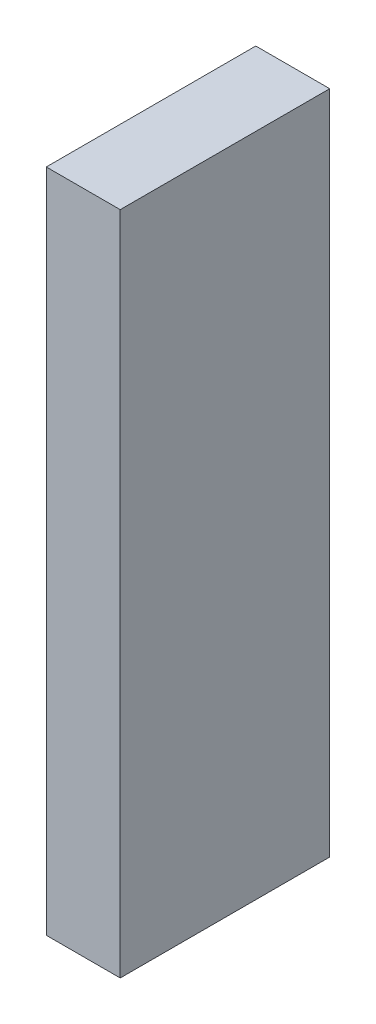
ISO-10303-21;
HEADER;
FILE_DESCRIPTION(('STEP AP214'),'2;1');
FILE_NAME('part.step','',(''),(''),'','','');
FILE_SCHEMA(('AUTOMOTIVE_DESIGN { 1 0 10303 214 1 1 1 1 }'));
ENDSEC;
DATA;
#1=APPLICATION_CONTEXT('core data for automotive mechanical design processes');
#2=APPLICATION_PROTOCOL_DEFINITION('international standard','automotive_design',2000,#1);
#3=PRODUCT_CONTEXT('',#1,'mechanical');
#4=PRODUCT('Part','Part','',(#3));
#5=PRODUCT_RELATED_PRODUCT_CATEGORY('part','',(#4));
#6=PRODUCT_DEFINITION_FORMATION('','',#4);
#7=PRODUCT_DEFINITION_CONTEXT('part definition',#1,'design');
#8=PRODUCT_DEFINITION('design','',#6,#7);
#9=PRODUCT_DEFINITION_SHAPE('','',#8);
#10=(LENGTH_UNIT() NAMED_UNIT(*) SI_UNIT(.MILLI.,.METRE.));
#11=(NAMED_UNIT(*) PLANE_ANGLE_UNIT() SI_UNIT($,.RADIAN.));
#12=(NAMED_UNIT(*) SI_UNIT($,.STERADIAN.) SOLID_ANGLE_UNIT());
#13=UNCERTAINTY_MEASURE_WITH_UNIT(LENGTH_MEASURE(1.E-05),#10,'distance_accuracy_value','');
#14=(GEOMETRIC_REPRESENTATION_CONTEXT(3) GLOBAL_UNCERTAINTY_ASSIGNED_CONTEXT((#13)) GLOBAL_UNIT_ASSIGNED_CONTEXT((#10,
#11,#12)) REPRESENTATION_CONTEXT('',''));
#15=CARTESIAN_POINT('',(0.,0.,0.));
#16=DIRECTION('',(0.,0.,1.));
#17=DIRECTION('',(1.,0.,0.));
#18=AXIS2_PLACEMENT_3D('',#15,#16,#17);
#19=CARTESIAN_POINT('',(2.44999828688201,2.69998244459617,0.));
#20=DIRECTION('',(-1.,1.19248806385031E-08,0.));
#21=DIRECTION('',(-1.19248806385031E-08,-1.,0.));
#22=AXIS2_PLACEMENT_3D('',#19,#20,#21);
#23=PLANE('',#22);
#24=DIRECTION('',(-1.19248806627069E-08,-1.,0.));
#25=VECTOR('',#24,1.);
#26=CARTESIAN_POINT('',(2.44999828688201,2.69998244459617,0.));
#27=LINE('',#26,#25);
#28=CARTESIAN_POINT('',(2.44999828688201,2.69998244459617,0.));
#29=VERTEX_POINT('',#28);
#30=CARTESIAN_POINT('',(2.44999822248774,-2.7000114518882,0.));
#31=VERTEX_POINT('',#30);
#32=EDGE_CURVE('E11',#29,#31,#27,.T.);
#33=ORIENTED_EDGE('',*,*,#32,.T.);
#34=DIRECTION('',(0.,0.,1.));
#35=VECTOR('',#34,1.);
#36=CARTESIAN_POINT('',(2.44999822248773,-2.7000114518882,0.));
#37=LINE('',#36,#35);
#38=CARTESIAN_POINT('',(2.44999822248774,-2.7000114518882,1.6999990940094));
#39=VERTEX_POINT('',#38);
#40=EDGE_CURVE('E88',#31,#39,#37,.T.);
#41=ORIENTED_EDGE('',*,*,#40,.T.);
#42=DIRECTION('',(-1.19248806627069E-08,-1.,0.));
#43=VECTOR('',#42,1.);
#44=CARTESIAN_POINT('',(2.44999828688201,2.69998244459617,1.6999990940094));
#45=LINE('',#44,#43);
#46=CARTESIAN_POINT('',(2.44999828688201,2.69998244459617,1.6999990940094));
#47=VERTEX_POINT('',#46);
#48=EDGE_CURVE('E83',#47,#39,#45,.T.);
#49=ORIENTED_EDGE('',*,*,#48,.F.);
#50=DIRECTION('',(0.,0.,1.));
#51=VECTOR('',#50,1.);
#52=CARTESIAN_POINT('',(2.44999828688201,2.69998244459619,0.));
#53=LINE('',#52,#51);
#54=EDGE_CURVE('E72',#29,#47,#53,.T.);
#55=ORIENTED_EDGE('',*,*,#54,.F.);
#56=EDGE_LOOP('',(#33,#41,#49,#55));
#57=FACE_BOUND('',#56,.T.);
#58=ADVANCED_FACE('F17',(#57),#23,.T.);
#59=CARTESIAN_POINT('',(2.44999822248774,-2.7000114518882,0.));
#60=DIRECTION('',(-1.19248806385031E-08,-1.,0.));
#61=DIRECTION('',(1.,-1.19248806385031E-08,0.));
#62=AXIS2_PLACEMENT_3D('',#59,#60,#61);
#63=PLANE('',#62);
#64=DIRECTION('',(1.,-1.1924880741852E-08,0.));
#65=VECTOR('',#64,1.);
#66=CARTESIAN_POINT('',(2.44999822248774,-2.7000114518882,0.));
#67=LINE('',#66,#65);
#68=CARTESIAN_POINT('',(3.0500005113061,-2.70001145904314,0.));
#69=VERTEX_POINT('',#68);
#70=EDGE_CURVE('E24',#31,#69,#67,.T.);
#71=ORIENTED_EDGE('',*,*,#70,.T.);
#72=DIRECTION('',(0.,0.,1.));
#73=VECTOR('',#72,1.);
#74=CARTESIAN_POINT('',(3.0500005113061,-2.70001145904316,0.));
#75=LINE('',#74,#73);
#76=CARTESIAN_POINT('',(3.0500005113061,-2.70001145904314,1.6999990940094));
#77=VERTEX_POINT('',#76);
#78=EDGE_CURVE('E85',#69,#77,#75,.T.);
#79=ORIENTED_EDGE('',*,*,#78,.T.);
#80=DIRECTION('',(1.,-1.1924880741852E-08,0.));
#81=VECTOR('',#80,1.);
#82=CARTESIAN_POINT('',(2.44999822248774,-2.7000114518882,1.6999990940094));
#83=LINE('',#82,#81);
#84=EDGE_CURVE('E66',#39,#77,#83,.T.);
#85=ORIENTED_EDGE('',*,*,#84,.F.);
#86=ORIENTED_EDGE('',*,*,#40,.F.);
#87=EDGE_LOOP('',(#71,#79,#85,#86));
#88=FACE_BOUND('',#87,.T.);
#89=ADVANCED_FACE('F89',(#88),#63,.T.);
#90=CARTESIAN_POINT('',(3.0500005113061,-2.70001145904314,0.));
#91=DIRECTION('',(1.,-1.19248806385031E-08,0.));
#92=DIRECTION('',(1.19248806385031E-08,1.,0.));
#93=AXIS2_PLACEMENT_3D('',#90,#91,#92);
#94=PLANE('',#93);
#95=DIRECTION('',(1.19248806627069E-08,1.,0.));
#96=VECTOR('',#95,1.);
#97=CARTESIAN_POINT('',(3.0500005113061,-2.70001145904314,0.));
#98=LINE('',#97,#96);
#99=CARTESIAN_POINT('',(3.05000057570037,2.69998243744124,0.));
#100=VERTEX_POINT('',#99);
#101=EDGE_CURVE('E62',#69,#100,#98,.T.);
#102=ORIENTED_EDGE('',*,*,#101,.T.);
#103=DIRECTION('',(0.,0.,1.));
#104=VECTOR('',#103,1.);
#105=CARTESIAN_POINT('',(3.05000057570038,2.69998243744124,0.));
#106=LINE('',#105,#104);
#107=CARTESIAN_POINT('',(3.05000057570037,2.69998243744124,1.6999990940094));
#108=VERTEX_POINT('',#107);
#109=EDGE_CURVE('E55',#100,#108,#106,.T.);
#110=ORIENTED_EDGE('',*,*,#109,.T.);
#111=DIRECTION('',(1.19248806627069E-08,1.,0.));
#112=VECTOR('',#111,1.);
#113=CARTESIAN_POINT('',(3.0500005113061,-2.70001145904314,1.6999990940094));
#114=LINE('',#113,#112);
#115=EDGE_CURVE('E59',#77,#108,#114,.T.);
#116=ORIENTED_EDGE('',*,*,#115,.F.);
#117=ORIENTED_EDGE('',*,*,#78,.F.);
#118=EDGE_LOOP('',(#102,#110,#116,#117));
#119=FACE_BOUND('',#118,.T.);
#120=ADVANCED_FACE('F57',(#119),#94,.T.);
#121=CARTESIAN_POINT('',(3.05000057570037,2.69998243744124,0.));
#122=DIRECTION('',(1.19248806385031E-08,1.,0.));
#123=DIRECTION('',(-1.,1.19248806385031E-08,0.));
#124=AXIS2_PLACEMENT_3D('',#121,#122,#123);
#125=PLANE('',#124);
#126=DIRECTION('',(-1.,1.1924880741852E-08,0.));
#127=VECTOR('',#126,1.);
#128=CARTESIAN_POINT('',(3.05000057570037,2.69998243744124,0.));
#129=LINE('',#128,#127);
#130=EDGE_CURVE('E65',#100,#29,#129,.T.);
#131=ORIENTED_EDGE('',*,*,#130,.T.);
#132=ORIENTED_EDGE('',*,*,#54,.T.);
#133=DIRECTION('',(-1.,1.1924880741852E-08,0.));
#134=VECTOR('',#133,1.);
#135=CARTESIAN_POINT('',(3.05000057570037,2.69998243744124,1.6999990940094));
#136=LINE('',#135,#134);
#137=EDGE_CURVE('E70',#108,#47,#136,.T.);
#138=ORIENTED_EDGE('',*,*,#137,.F.);
#139=ORIENTED_EDGE('',*,*,#109,.F.);
#140=EDGE_LOOP('',(#131,#132,#138,#139));
#141=FACE_BOUND('',#140,.T.);
#142=ADVANCED_FACE('F71',(#141),#125,.T.);
#143=CARTESIAN_POINT('',(65.7749938964844,-429.450012207031,1.6999990940094));
#144=DIRECTION('',(0.,0.,1.));
#145=DIRECTION('',(1.19248806385031E-08,1.,0.));
#146=AXIS2_PLACEMENT_3D('',#143,#144,#145);
#147=PLANE('',#146);
#148=ORIENTED_EDGE('',*,*,#48,.T.);
#149=ORIENTED_EDGE('',*,*,#84,.T.);
#150=ORIENTED_EDGE('',*,*,#115,.T.);
#151=ORIENTED_EDGE('',*,*,#137,.T.);
#152=EDGE_LOOP('',(#148,#149,#150,#151));
#153=FACE_BOUND('',#152,.T.);
#154=ADVANCED_FACE('F76',(#153),#147,.T.);
#155=CARTESIAN_POINT('',(65.7749938964844,-429.450012207031,0.));
#156=DIRECTION('',(0.,0.,1.));
#157=DIRECTION('',(1.19248806385031E-08,1.,0.));
#158=AXIS2_PLACEMENT_3D('',#155,#156,#157);
#159=PLANE('',#158);
#160=ORIENTED_EDGE('',*,*,#130,.F.);
#161=ORIENTED_EDGE('',*,*,#101,.F.);
#162=ORIENTED_EDGE('',*,*,#70,.F.);
#163=ORIENTED_EDGE('',*,*,#32,.F.);
#164=EDGE_LOOP('',(#160,#161,#162,#163));
#165=FACE_BOUND('',#164,.T.);
#166=ADVANCED_FACE('F91',(#165),#159,.F.);
#167=CLOSED_SHELL('',(#58,#89,#120,#142,#154,#166));
#168=MANIFOLD_SOLID_BREP('B1',#167);
#169=ADVANCED_BREP_SHAPE_REPRESENTATION('',(#18,#168),#14);
#170=SHAPE_DEFINITION_REPRESENTATION(#9,#169);
ENDSEC;
END-ISO-10303-21;
